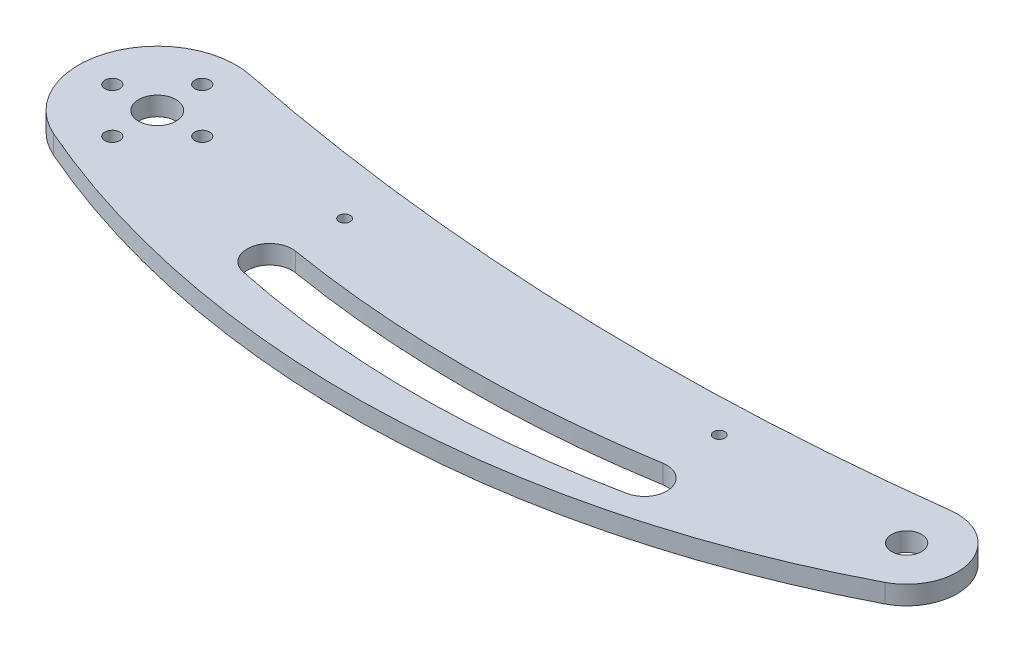
ISO-10303-21;
HEADER;
FILE_DESCRIPTION(('STEP AP214'),'2;1');
FILE_NAME('part.step','',(''),(''),'','','');
FILE_SCHEMA(('AUTOMOTIVE_DESIGN { 1 0 10303 214 1 1 1 1 }'));
ENDSEC;
DATA;
#1=APPLICATION_CONTEXT('core data for automotive mechanical design processes');
#2=APPLICATION_PROTOCOL_DEFINITION('international standard','automotive_design',2000,#1);
#3=PRODUCT_CONTEXT('',#1,'mechanical');
#4=PRODUCT('Part','Part','',(#3));
#5=PRODUCT_RELATED_PRODUCT_CATEGORY('part','',(#4));
#6=PRODUCT_DEFINITION_FORMATION('','',#4);
#7=PRODUCT_DEFINITION_CONTEXT('part definition',#1,'design');
#8=PRODUCT_DEFINITION('design','',#6,#7);
#9=PRODUCT_DEFINITION_SHAPE('','',#8);
#10=(LENGTH_UNIT() NAMED_UNIT(*) SI_UNIT(.MILLI.,.METRE.));
#11=(NAMED_UNIT(*) PLANE_ANGLE_UNIT() SI_UNIT($,.RADIAN.));
#12=(NAMED_UNIT(*) SI_UNIT($,.STERADIAN.) SOLID_ANGLE_UNIT());
#13=UNCERTAINTY_MEASURE_WITH_UNIT(LENGTH_MEASURE(1.E-05),#10,'distance_accuracy_value','');
#14=(GEOMETRIC_REPRESENTATION_CONTEXT(3) GLOBAL_UNCERTAINTY_ASSIGNED_CONTEXT((#13)) GLOBAL_UNIT_ASSIGNED_CONTEXT((#10,
#11,#12)) REPRESENTATION_CONTEXT('',''));
#15=CARTESIAN_POINT('',(0.,0.,0.));
#16=DIRECTION('',(0.,0.,1.));
#17=DIRECTION('',(1.,0.,0.));
#18=AXIS2_PLACEMENT_3D('',#15,#16,#17);
#19=CARTESIAN_POINT('',(161.5734375,5.,-304.333635660657));
#20=DIRECTION('',(0.,1.,0.));
#21=DIRECTION('',(0.,0.,1.));
#22=AXIS2_PLACEMENT_3D('',#19,#20,#21);
#23=PLANE('',#22);
#24=CARTESIAN_POINT('',(50.,5.,0.));
#25=DIRECTION('',(0.,1.,0.));
#26=DIRECTION('',(0.,0.,1.));
#27=AXIS2_PLACEMENT_3D('',#24,#25,#26);
#28=CIRCLE('',#27,1.5);
#29=CARTESIAN_POINT('',(50.,5.,1.5));
#30=VERTEX_POINT('',#29);
#31=EDGE_CURVE('E144',#30,#30,#28,.T.);
#32=ORIENTED_EDGE('',*,*,#31,.F.);
#33=EDGE_LOOP('',(#32));
#34=FACE_BOUND('',#33,.T.);
#35=CARTESIAN_POINT('',(-2.73805120588741E-12,5.,12.));
#36=DIRECTION('',(0.,1.,0.));
#37=DIRECTION('',(0.,0.,1.));
#38=AXIS2_PLACEMENT_3D('',#35,#36,#37);
#39=CIRCLE('',#38,1.99999999999742);
#40=CARTESIAN_POINT('',(-2.73805120588741E-12,5.,13.9999999999974));
#41=VERTEX_POINT('',#40);
#42=EDGE_CURVE('E168',#41,#41,#39,.T.);
#43=ORIENTED_EDGE('',*,*,#42,.F.);
#44=EDGE_LOOP('',(#43));
#45=FACE_BOUND('',#44,.T.);
#46=CARTESIAN_POINT('',(200.,5.,0.));
#47=DIRECTION('',(0.,1.,0.));
#48=DIRECTION('',(0.,0.,1.));
#49=AXIS2_PLACEMENT_3D('',#46,#47,#48);
#50=CIRCLE('',#49,3.99999999999999);
#51=CARTESIAN_POINT('',(200.,5.,3.99999999999999));
#52=VERTEX_POINT('',#51);
#53=EDGE_CURVE('E184',#52,#52,#50,.T.);
#54=ORIENTED_EDGE('',*,*,#53,.F.);
#55=EDGE_LOOP('',(#54));
#56=FACE_BOUND('',#55,.T.);
#57=CARTESIAN_POINT('',(0.,5.,0.));
#58=DIRECTION('',(0.,1.,0.));
#59=DIRECTION('',(0.,0.,1.));
#60=AXIS2_PLACEMENT_3D('',#57,#58,#59);
#61=CIRCLE('',#60,5.);
#62=CARTESIAN_POINT('',(0.,5.,5.));
#63=VERTEX_POINT('',#62);
#64=EDGE_CURVE('E200',#63,#63,#61,.T.);
#65=ORIENTED_EDGE('',*,*,#64,.F.);
#66=EDGE_LOOP('',(#65));
#67=FACE_BOUND('',#66,.T.);
#68=CARTESIAN_POINT('',(123.146875,5.,-608.667271321314));
#69=DIRECTION('',(0.,-1.,0.));
#70=DIRECTION('',(0.,0.,1.));
#71=AXIS2_PLACEMENT_3D('',#68,#69,#70);
#72=CIRCLE('',#71,600.);
#73=CARTESIAN_POINT('',(198.308855440098,5.,-13.3936563371438));
#74=VERTEX_POINT('',#73);
#75=CARTESIAN_POINT('',(4.16438707729469,5.,-20.5829512041024));
#76=VERTEX_POINT('',#75);
#77=EDGE_CURVE('E208',#74,#76,#72,.T.);
#78=ORIENTED_EDGE('',*,*,#77,.T.);
#79=CARTESIAN_POINT('',(0.,5.,0.));
#80=DIRECTION('',(0.,1.,0.));
#81=DIRECTION('',(0.,0.,1.));
#82=AXIS2_PLACEMENT_3D('',#79,#80,#81);
#83=CIRCLE('',#82,21.);
#84=CARTESIAN_POINT('',(-8.36990993449789,5.,19.2599223178182));
#85=VERTEX_POINT('',#84);
#86=EDGE_CURVE('E212',#76,#85,#83,.T.);
#87=ORIENTED_EDGE('',*,*,#86,.T.);
#88=CARTESIAN_POINT('',(91.271875,5.,-210.024867180018));
#89=DIRECTION('',(0.,1.,0.));
#90=DIRECTION('',(0.,0.,1.));
#91=AXIS2_PLACEMENT_3D('',#88,#89,#90);
#92=CIRCLE('',#91,250.);
#93=CARTESIAN_POINT('',(206.206468023256,5.,11.9887344901913));
#94=VERTEX_POINT('',#93);
#95=EDGE_CURVE('E216',#85,#94,#92,.T.);
#96=ORIENTED_EDGE('',*,*,#95,.T.);
#97=CARTESIAN_POINT('',(200.,5.,0.));
#98=DIRECTION('',(0.,1.,0.));
#99=DIRECTION('',(0.,0.,1.));
#100=AXIS2_PLACEMENT_3D('',#97,#98,#99);
#101=CIRCLE('',#100,13.5);
#102=EDGE_CURVE('E219',#94,#74,#101,.T.);
#103=ORIENTED_EDGE('',*,*,#102,.T.);
#104=EDGE_LOOP('',(#78,#87,#96,#103));
#105=FACE_BOUND('',#104,.T.);
#106=CARTESIAN_POINT('',(0.,5.,-12.));
#107=DIRECTION('',(0.,1.,0.));
#108=DIRECTION('',(0.,0.,1.));
#109=AXIS2_PLACEMENT_3D('',#106,#107,#108);
#110=CIRCLE('',#109,2.);
#111=CARTESIAN_POINT('',(0.,5.,-10.));
#112=VERTEX_POINT('',#111);
#113=EDGE_CURVE('E192',#112,#112,#110,.T.);
#114=ORIENTED_EDGE('',*,*,#113,.F.);
#115=EDGE_LOOP('',(#114));
#116=FACE_BOUND('',#115,.T.);
#117=CARTESIAN_POINT('',(12.,5.,0.));
#118=DIRECTION('',(0.,1.,0.));
#119=DIRECTION('',(0.,0.,1.));
#120=AXIS2_PLACEMENT_3D('',#117,#118,#119);
#121=CIRCLE('',#120,2.00000000000004);
#122=CARTESIAN_POINT('',(12.,5.,1.99999999999999));
#123=VERTEX_POINT('',#122);
#124=EDGE_CURVE('E176',#123,#123,#121,.T.);
#125=ORIENTED_EDGE('',*,*,#124,.F.);
#126=EDGE_LOOP('',(#125));
#127=FACE_BOUND('',#126,.T.);
#128=CARTESIAN_POINT('',(-12.,5.,0.));
#129=DIRECTION('',(0.,1.,0.));
#130=DIRECTION('',(0.,0.,1.));
#131=AXIS2_PLACEMENT_3D('',#128,#129,#130);
#132=CIRCLE('',#131,1.99999999999999);
#133=CARTESIAN_POINT('',(-12.,5.,1.9999999999999));
#134=VERTEX_POINT('',#133);
#135=EDGE_CURVE('E160',#134,#134,#132,.T.);
#136=ORIENTED_EDGE('',*,*,#135,.F.);
#137=EDGE_LOOP('',(#136));
#138=FACE_BOUND('',#137,.T.);
#139=CARTESIAN_POINT('',(150.,5.,20.));
#140=DIRECTION('',(0.,1.,0.));
#141=DIRECTION('',(0.,0.,1.));
#142=AXIS2_PLACEMENT_3D('',#139,#140,#141);
#143=CIRCLE('',#142,6.00000000000001);
#144=CARTESIAN_POINT('',(151.229508397051,5.,25.8726747825485));
#145=VERTEX_POINT('',#144);
#146=CARTESIAN_POINT('',(149.019607843137,5.,14.08063928969));
#147=VERTEX_POINT('',#146);
#148=EDGE_CURVE('E118',#145,#147,#143,.T.);
#149=ORIENTED_EDGE('',*,*,#148,.F.);
#150=CARTESIAN_POINT('',(100.,5.,-218.822109529248));
#151=DIRECTION('',(0.,1.,0.));
#152=DIRECTION('',(0.,0.,1.));
#153=AXIS2_PLACEMENT_3D('',#150,#151,#152);
#154=CIRCLE('',#153,250.);
#155=CARTESIAN_POINT('',(48.7704916029489,5.,25.8726747825485));
#156=VERTEX_POINT('',#155);
#157=EDGE_CURVE('E109',#156,#145,#154,.T.);
#158=ORIENTED_EDGE('',*,*,#157,.F.);
#159=CARTESIAN_POINT('',(50.,5.,20.));
#160=DIRECTION('',(0.,1.,0.));
#161=DIRECTION('',(0.,0.,1.));
#162=AXIS2_PLACEMENT_3D('',#159,#160,#161);
#163=CIRCLE('',#162,6.);
#164=CARTESIAN_POINT('',(50.9803921568628,5.,14.08063928969));
#165=VERTEX_POINT('',#164);
#166=EDGE_CURVE('E136',#165,#156,#163,.T.);
#167=ORIENTED_EDGE('',*,*,#166,.F.);
#168=CARTESIAN_POINT('',(100.,5.,-281.887396225811));
#169=DIRECTION('',(0.,-1.,0.));
#170=DIRECTION('',(0.,0.,1.));
#171=AXIS2_PLACEMENT_3D('',#168,#169,#170);
#172=CIRCLE('',#171,300.);
#173=EDGE_CURVE('E132',#147,#165,#172,.T.);
#174=ORIENTED_EDGE('',*,*,#173,.F.);
#175=EDGE_LOOP('',(#149,#158,#167,#174));
#176=FACE_BOUND('',#175,.T.);
#177=CARTESIAN_POINT('',(150.,5.,0.));
#178=DIRECTION('',(0.,1.,0.));
#179=DIRECTION('',(0.,0.,1.));
#180=AXIS2_PLACEMENT_3D('',#177,#178,#179);
#181=CIRCLE('',#180,1.5);
#182=CARTESIAN_POINT('',(150.,5.,1.5));
#183=VERTEX_POINT('',#182);
#184=EDGE_CURVE('E342',#183,#183,#181,.T.);
#185=ORIENTED_EDGE('',*,*,#184,.F.);
#186=EDGE_LOOP('',(#185));
#187=FACE_BOUND('',#186,.T.);
#188=ADVANCED_FACE('F43',(#34,#45,#56,#67,#105,#116,#127,#138,#176,#187),#23,.T.);
#189=CARTESIAN_POINT('',(161.5734375,0.,-304.333635660657));
#190=DIRECTION('',(0.,1.,0.));
#191=DIRECTION('',(0.,0.,1.));
#192=AXIS2_PLACEMENT_3D('',#189,#190,#191);
#193=PLANE('',#192);
#194=CARTESIAN_POINT('',(-12.,0.,0.));
#195=DIRECTION('',(0.,1.,0.));
#196=DIRECTION('',(0.,0.,1.));
#197=AXIS2_PLACEMENT_3D('',#194,#195,#196);
#198=CIRCLE('',#197,1.99999999999999);
#199=CARTESIAN_POINT('',(-12.,0.,1.9999999999999));
#200=VERTEX_POINT('',#199);
#201=EDGE_CURVE('E127',#200,#200,#198,.T.);
#202=ORIENTED_EDGE('',*,*,#201,.T.);
#203=EDGE_LOOP('',(#202));
#204=FACE_BOUND('',#203,.T.);
#205=CARTESIAN_POINT('',(-2.73805120588741E-12,0.,12.));
#206=DIRECTION('',(0.,1.,0.));
#207=DIRECTION('',(0.,0.,1.));
#208=AXIS2_PLACEMENT_3D('',#205,#206,#207);
#209=CIRCLE('',#208,1.99999999999742);
#210=CARTESIAN_POINT('',(-2.73805120588741E-12,0.,13.9999999999974));
#211=VERTEX_POINT('',#210);
#212=EDGE_CURVE('E164',#211,#211,#209,.T.);
#213=ORIENTED_EDGE('',*,*,#212,.T.);
#214=EDGE_LOOP('',(#213));
#215=FACE_BOUND('',#214,.T.);
#216=CARTESIAN_POINT('',(12.,0.,0.));
#217=DIRECTION('',(0.,1.,0.));
#218=DIRECTION('',(0.,0.,1.));
#219=AXIS2_PLACEMENT_3D('',#216,#217,#218);
#220=CIRCLE('',#219,2.00000000000004);
#221=CARTESIAN_POINT('',(12.,0.,1.99999999999999));
#222=VERTEX_POINT('',#221);
#223=EDGE_CURVE('E172',#222,#222,#220,.T.);
#224=ORIENTED_EDGE('',*,*,#223,.T.);
#225=EDGE_LOOP('',(#224));
#226=FACE_BOUND('',#225,.T.);
#227=CARTESIAN_POINT('',(200.,0.,0.));
#228=DIRECTION('',(0.,1.,0.));
#229=DIRECTION('',(0.,0.,1.));
#230=AXIS2_PLACEMENT_3D('',#227,#228,#229);
#231=CIRCLE('',#230,3.99999999999999);
#232=CARTESIAN_POINT('',(200.,0.,3.99999999999999));
#233=VERTEX_POINT('',#232);
#234=EDGE_CURVE('E180',#233,#233,#231,.T.);
#235=ORIENTED_EDGE('',*,*,#234,.T.);
#236=EDGE_LOOP('',(#235));
#237=FACE_BOUND('',#236,.T.);
#238=CARTESIAN_POINT('',(0.,0.,-12.));
#239=DIRECTION('',(0.,1.,0.));
#240=DIRECTION('',(0.,0.,1.));
#241=AXIS2_PLACEMENT_3D('',#238,#239,#240);
#242=CIRCLE('',#241,2.);
#243=CARTESIAN_POINT('',(0.,0.,-10.));
#244=VERTEX_POINT('',#243);
#245=EDGE_CURVE('E188',#244,#244,#242,.T.);
#246=ORIENTED_EDGE('',*,*,#245,.T.);
#247=EDGE_LOOP('',(#246));
#248=FACE_BOUND('',#247,.T.);
#249=CARTESIAN_POINT('',(0.,0.,0.));
#250=DIRECTION('',(0.,1.,0.));
#251=DIRECTION('',(0.,0.,1.));
#252=AXIS2_PLACEMENT_3D('',#249,#250,#251);
#253=CIRCLE('',#252,5.);
#254=CARTESIAN_POINT('',(0.,0.,5.));
#255=VERTEX_POINT('',#254);
#256=EDGE_CURVE('E196',#255,#255,#253,.T.);
#257=ORIENTED_EDGE('',*,*,#256,.T.);
#258=EDGE_LOOP('',(#257));
#259=FACE_BOUND('',#258,.T.);
#260=CARTESIAN_POINT('',(123.146875,0.,-608.667271321314));
#261=DIRECTION('',(0.,-1.,0.));
#262=DIRECTION('',(0.,0.,1.));
#263=AXIS2_PLACEMENT_3D('',#260,#261,#262);
#264=CIRCLE('',#263,600.);
#265=CARTESIAN_POINT('',(198.308855440098,0.,-13.3936563371438));
#266=VERTEX_POINT('',#265);
#267=CARTESIAN_POINT('',(4.16438707729469,0.,-20.5829512041024));
#268=VERTEX_POINT('',#267);
#269=EDGE_CURVE('E204',#266,#268,#264,.T.);
#270=ORIENTED_EDGE('',*,*,#269,.F.);
#271=CARTESIAN_POINT('',(200.,0.,0.));
#272=DIRECTION('',(0.,1.,0.));
#273=DIRECTION('',(0.,0.,1.));
#274=AXIS2_PLACEMENT_3D('',#271,#272,#273);
#275=CIRCLE('',#274,13.5);
#276=CARTESIAN_POINT('',(206.206468023256,0.,11.9887344901913));
#277=VERTEX_POINT('',#276);
#278=EDGE_CURVE('E213',#277,#266,#275,.T.);
#279=ORIENTED_EDGE('',*,*,#278,.F.);
#280=CARTESIAN_POINT('',(91.271875,0.,-210.024867180018));
#281=DIRECTION('',(0.,1.,0.));
#282=DIRECTION('',(0.,0.,1.));
#283=AXIS2_PLACEMENT_3D('',#280,#281,#282);
#284=CIRCLE('',#283,250.);
#285=CARTESIAN_POINT('',(-8.36990993449789,0.,19.2599223178182));
#286=VERTEX_POINT('',#285);
#287=EDGE_CURVE('E229',#286,#277,#284,.T.);
#288=ORIENTED_EDGE('',*,*,#287,.F.);
#289=CARTESIAN_POINT('',(0.,0.,0.));
#290=DIRECTION('',(0.,1.,0.));
#291=DIRECTION('',(0.,0.,1.));
#292=AXIS2_PLACEMENT_3D('',#289,#290,#291);
#293=CIRCLE('',#292,21.);
#294=EDGE_CURVE('E226',#268,#286,#293,.T.);
#295=ORIENTED_EDGE('',*,*,#294,.F.);
#296=EDGE_LOOP('',(#270,#279,#288,#295));
#297=FACE_BOUND('',#296,.T.);
#298=CARTESIAN_POINT('',(100.,0.,-218.822109529248));
#299=DIRECTION('',(0.,1.,0.));
#300=DIRECTION('',(0.,0.,1.));
#301=AXIS2_PLACEMENT_3D('',#298,#299,#300);
#302=CIRCLE('',#301,250.);
#303=CARTESIAN_POINT('',(48.7704916029489,0.,25.8726747825485));
#304=VERTEX_POINT('',#303);
#305=CARTESIAN_POINT('',(151.229508397051,0.,25.8726747825485));
#306=VERTEX_POINT('',#305);
#307=EDGE_CURVE('E67',#304,#306,#302,.T.);
#308=ORIENTED_EDGE('',*,*,#307,.T.);
#309=CARTESIAN_POINT('',(150.,0.,20.));
#310=DIRECTION('',(0.,1.,0.));
#311=DIRECTION('',(0.,0.,1.));
#312=AXIS2_PLACEMENT_3D('',#309,#310,#311);
#313=CIRCLE('',#312,6.00000000000001);
#314=CARTESIAN_POINT('',(149.019607843137,0.,14.08063928969));
#315=VERTEX_POINT('',#314);
#316=EDGE_CURVE('E125',#306,#315,#313,.T.);
#317=ORIENTED_EDGE('',*,*,#316,.T.);
#318=CARTESIAN_POINT('',(100.,0.,-281.887396225811));
#319=DIRECTION('',(0.,-1.,0.));
#320=DIRECTION('',(0.,0.,1.));
#321=AXIS2_PLACEMENT_3D('',#318,#319,#320);
#322=CIRCLE('',#321,300.);
#323=CARTESIAN_POINT('',(50.9803921568628,0.,14.0806392896899));
#324=VERTEX_POINT('',#323);
#325=EDGE_CURVE('E147',#315,#324,#322,.T.);
#326=ORIENTED_EDGE('',*,*,#325,.T.);
#327=CARTESIAN_POINT('',(50.,0.,20.));
#328=DIRECTION('',(0.,1.,0.));
#329=DIRECTION('',(0.,0.,1.));
#330=AXIS2_PLACEMENT_3D('',#327,#328,#329);
#331=CIRCLE('',#330,6.);
#332=EDGE_CURVE('E119',#324,#304,#331,.T.);
#333=ORIENTED_EDGE('',*,*,#332,.T.);
#334=EDGE_LOOP('',(#308,#317,#326,#333));
#335=FACE_BOUND('',#334,.T.);
#336=CARTESIAN_POINT('',(50.,0.,0.));
#337=DIRECTION('',(0.,1.,0.));
#338=DIRECTION('',(0.,0.,1.));
#339=AXIS2_PLACEMENT_3D('',#336,#337,#338);
#340=CIRCLE('',#339,1.5);
#341=CARTESIAN_POINT('',(50.,0.,1.5));
#342=VERTEX_POINT('',#341);
#343=EDGE_CURVE('E350',#342,#342,#340,.T.);
#344=ORIENTED_EDGE('',*,*,#343,.T.);
#345=EDGE_LOOP('',(#344));
#346=FACE_BOUND('',#345,.T.);
#347=CARTESIAN_POINT('',(150.,0.,0.));
#348=DIRECTION('',(0.,1.,0.));
#349=DIRECTION('',(0.,0.,1.));
#350=AXIS2_PLACEMENT_3D('',#347,#348,#349);
#351=CIRCLE('',#350,1.5);
#352=CARTESIAN_POINT('',(150.,0.,1.5));
#353=VERTEX_POINT('',#352);
#354=EDGE_CURVE('E345',#353,#353,#351,.T.);
#355=ORIENTED_EDGE('',*,*,#354,.T.);
#356=EDGE_LOOP('',(#355));
#357=FACE_BOUND('',#356,.T.);
#358=ADVANCED_FACE('F252',(#204,#215,#226,#237,#248,#259,#297,#335,#346,#357),#193,.F.);
#359=CARTESIAN_POINT('',(123.146875,5.,-608.667271321314));
#360=DIRECTION('',(0.,-1.,0.));
#361=DIRECTION('',(0.,0.,-1.));
#362=AXIS2_PLACEMENT_3D('',#359,#360,#361);
#363=CYLINDRICAL_SURFACE('',#362,600.);
#364=ORIENTED_EDGE('',*,*,#269,.T.);
#365=DIRECTION('',(0.,-1.,0.));
#366=VECTOR('',#365,1.);
#367=CARTESIAN_POINT('',(4.16438707729469,5.,-20.5829512041024));
#368=LINE('',#367,#366);
#369=EDGE_CURVE('E11',#76,#268,#368,.T.);
#370=ORIENTED_EDGE('',*,*,#369,.F.);
#371=ORIENTED_EDGE('',*,*,#77,.F.);
#372=DIRECTION('',(0.,-1.,0.));
#373=VECTOR('',#372,1.);
#374=CARTESIAN_POINT('',(198.308855440098,5.,-13.3936563371438));
#375=LINE('',#374,#373);
#376=EDGE_CURVE('E222',#74,#266,#375,.T.);
#377=ORIENTED_EDGE('',*,*,#376,.T.);
#378=EDGE_LOOP('',(#364,#370,#371,#377));
#379=FACE_BOUND('',#378,.T.);
#380=ADVANCED_FACE('F45',(#379),#363,.F.);
#381=CARTESIAN_POINT('',(0.,5.,0.));
#382=DIRECTION('',(0.,-1.,0.));
#383=DIRECTION('',(0.,0.,-1.));
#384=AXIS2_PLACEMENT_3D('',#381,#382,#383);
#385=CYLINDRICAL_SURFACE('',#384,21.);
#386=ORIENTED_EDGE('',*,*,#294,.T.);
#387=DIRECTION('',(0.,-1.,0.));
#388=VECTOR('',#387,1.);
#389=CARTESIAN_POINT('',(-8.36990993449789,5.,19.2599223178182));
#390=LINE('',#389,#388);
#391=EDGE_CURVE('E52',#85,#286,#390,.T.);
#392=ORIENTED_EDGE('',*,*,#391,.F.);
#393=ORIENTED_EDGE('',*,*,#86,.F.);
#394=ORIENTED_EDGE('',*,*,#369,.T.);
#395=EDGE_LOOP('',(#386,#392,#393,#394));
#396=FACE_BOUND('',#395,.T.);
#397=ADVANCED_FACE('F263',(#396),#385,.T.);
#398=CARTESIAN_POINT('',(91.271875,5.,-210.024867180018));
#399=DIRECTION('',(0.,-1.,0.));
#400=DIRECTION('',(0.,0.,-1.));
#401=AXIS2_PLACEMENT_3D('',#398,#399,#400);
#402=CYLINDRICAL_SURFACE('',#401,250.);
#403=ORIENTED_EDGE('',*,*,#287,.T.);
#404=DIRECTION('',(0.,-1.,0.));
#405=VECTOR('',#404,1.);
#406=CARTESIAN_POINT('',(206.206468023256,5.,11.9887344901913));
#407=LINE('',#406,#405);
#408=EDGE_CURVE('E237',#94,#277,#407,.T.);
#409=ORIENTED_EDGE('',*,*,#408,.F.);
#410=ORIENTED_EDGE('',*,*,#95,.F.);
#411=ORIENTED_EDGE('',*,*,#391,.T.);
#412=EDGE_LOOP('',(#403,#409,#410,#411));
#413=FACE_BOUND('',#412,.T.);
#414=ADVANCED_FACE('F246',(#413),#402,.T.);
#415=CARTESIAN_POINT('',(200.,5.,0.));
#416=DIRECTION('',(0.,-1.,0.));
#417=DIRECTION('',(0.,0.,-1.));
#418=AXIS2_PLACEMENT_3D('',#415,#416,#417);
#419=CYLINDRICAL_SURFACE('',#418,13.5);
#420=ORIENTED_EDGE('',*,*,#278,.T.);
#421=ORIENTED_EDGE('',*,*,#376,.F.);
#422=ORIENTED_EDGE('',*,*,#102,.F.);
#423=ORIENTED_EDGE('',*,*,#408,.T.);
#424=EDGE_LOOP('',(#420,#421,#422,#423));
#425=FACE_BOUND('',#424,.T.);
#426=ADVANCED_FACE('F256',(#425),#419,.T.);
#427=CARTESIAN_POINT('',(0.,5.,0.));
#428=DIRECTION('',(0.,-1.,0.));
#429=DIRECTION('',(0.,0.,-1.));
#430=AXIS2_PLACEMENT_3D('',#427,#428,#429);
#431=CYLINDRICAL_SURFACE('',#430,5.);
#432=ORIENTED_EDGE('',*,*,#64,.T.);
#433=EDGE_LOOP('',(#432));
#434=FACE_BOUND('',#433,.T.);
#435=ORIENTED_EDGE('',*,*,#256,.F.);
#436=EDGE_LOOP('',(#435));
#437=FACE_BOUND('',#436,.T.);
#438=ADVANCED_FACE('F281',(#434,#437),#431,.F.);
#439=CARTESIAN_POINT('',(0.,5.,-12.));
#440=DIRECTION('',(0.,-1.,0.));
#441=DIRECTION('',(0.,0.,-1.));
#442=AXIS2_PLACEMENT_3D('',#439,#440,#441);
#443=CYLINDRICAL_SURFACE('',#442,2.);
#444=ORIENTED_EDGE('',*,*,#113,.T.);
#445=EDGE_LOOP('',(#444));
#446=FACE_BOUND('',#445,.T.);
#447=ORIENTED_EDGE('',*,*,#245,.F.);
#448=EDGE_LOOP('',(#447));
#449=FACE_BOUND('',#448,.T.);
#450=ADVANCED_FACE('F288',(#446,#449),#443,.F.);
#451=CARTESIAN_POINT('',(200.,5.,0.));
#452=DIRECTION('',(0.,-1.,0.));
#453=DIRECTION('',(0.,0.,-1.));
#454=AXIS2_PLACEMENT_3D('',#451,#452,#453);
#455=CYLINDRICAL_SURFACE('',#454,3.99999999999999);
#456=ORIENTED_EDGE('',*,*,#53,.T.);
#457=EDGE_LOOP('',(#456));
#458=FACE_BOUND('',#457,.T.);
#459=ORIENTED_EDGE('',*,*,#234,.F.);
#460=EDGE_LOOP('',(#459));
#461=FACE_BOUND('',#460,.T.);
#462=ADVANCED_FACE('F293',(#458,#461),#455,.F.);
#463=CARTESIAN_POINT('',(12.,5.,0.));
#464=DIRECTION('',(0.,-1.,0.));
#465=DIRECTION('',(0.,0.,-1.));
#466=AXIS2_PLACEMENT_3D('',#463,#464,#465);
#467=CYLINDRICAL_SURFACE('',#466,2.00000000000004);
#468=ORIENTED_EDGE('',*,*,#124,.T.);
#469=EDGE_LOOP('',(#468));
#470=FACE_BOUND('',#469,.T.);
#471=ORIENTED_EDGE('',*,*,#223,.F.);
#472=EDGE_LOOP('',(#471));
#473=FACE_BOUND('',#472,.T.);
#474=ADVANCED_FACE('F303',(#470,#473),#467,.F.);
#475=CARTESIAN_POINT('',(-2.73805120588741E-12,5.,12.));
#476=DIRECTION('',(0.,-1.,0.));
#477=DIRECTION('',(0.,0.,-1.));
#478=AXIS2_PLACEMENT_3D('',#475,#476,#477);
#479=CYLINDRICAL_SURFACE('',#478,1.99999999999742);
#480=ORIENTED_EDGE('',*,*,#42,.T.);
#481=EDGE_LOOP('',(#480));
#482=FACE_BOUND('',#481,.T.);
#483=ORIENTED_EDGE('',*,*,#212,.F.);
#484=EDGE_LOOP('',(#483));
#485=FACE_BOUND('',#484,.T.);
#486=ADVANCED_FACE('F310',(#482,#485),#479,.F.);
#487=CARTESIAN_POINT('',(-12.,5.,0.));
#488=DIRECTION('',(0.,-1.,0.));
#489=DIRECTION('',(0.,0.,-1.));
#490=AXIS2_PLACEMENT_3D('',#487,#488,#489);
#491=CYLINDRICAL_SURFACE('',#490,1.99999999999999);
#492=ORIENTED_EDGE('',*,*,#135,.T.);
#493=EDGE_LOOP('',(#492));
#494=FACE_BOUND('',#493,.T.);
#495=ORIENTED_EDGE('',*,*,#201,.F.);
#496=EDGE_LOOP('',(#495));
#497=FACE_BOUND('',#496,.T.);
#498=ADVANCED_FACE('F314',(#494,#497),#491,.F.);
#499=CARTESIAN_POINT('',(100.,5.,-218.822109529248));
#500=DIRECTION('',(0.,-1.,0.));
#501=DIRECTION('',(0.,0.,-1.));
#502=AXIS2_PLACEMENT_3D('',#499,#500,#501);
#503=CYLINDRICAL_SURFACE('',#502,250.);
#504=ORIENTED_EDGE('',*,*,#307,.F.);
#505=DIRECTION('',(0.,-1.,0.));
#506=VECTOR('',#505,1.);
#507=CARTESIAN_POINT('',(48.7704916029489,5.,25.8726747825485));
#508=LINE('',#507,#506);
#509=EDGE_CURVE('E113',#156,#304,#508,.T.);
#510=ORIENTED_EDGE('',*,*,#509,.F.);
#511=ORIENTED_EDGE('',*,*,#157,.T.);
#512=DIRECTION('',(0.,-1.,0.));
#513=VECTOR('',#512,1.);
#514=CARTESIAN_POINT('',(151.229508397051,5.,25.8726747825485));
#515=LINE('',#514,#513);
#516=EDGE_CURVE('E112',#145,#306,#515,.T.);
#517=ORIENTED_EDGE('',*,*,#516,.T.);
#518=EDGE_LOOP('',(#504,#510,#511,#517));
#519=FACE_BOUND('',#518,.T.);
#520=ADVANCED_FACE('F111',(#519),#503,.F.);
#521=CARTESIAN_POINT('',(150.,5.,20.));
#522=DIRECTION('',(0.,-1.,0.));
#523=DIRECTION('',(0.,0.,-1.));
#524=AXIS2_PLACEMENT_3D('',#521,#522,#523);
#525=CYLINDRICAL_SURFACE('',#524,6.00000000000001);
#526=ORIENTED_EDGE('',*,*,#316,.F.);
#527=ORIENTED_EDGE('',*,*,#516,.F.);
#528=ORIENTED_EDGE('',*,*,#148,.T.);
#529=DIRECTION('',(0.,-1.,0.));
#530=VECTOR('',#529,1.);
#531=CARTESIAN_POINT('',(149.019607843137,5.,14.08063928969));
#532=LINE('',#531,#530);
#533=EDGE_CURVE('E128',#147,#315,#532,.T.);
#534=ORIENTED_EDGE('',*,*,#533,.T.);
#535=EDGE_LOOP('',(#526,#527,#528,#534));
#536=FACE_BOUND('',#535,.T.);
#537=ADVANCED_FACE('F122',(#536),#525,.F.);
#538=CARTESIAN_POINT('',(100.,5.,-281.887396225811));
#539=DIRECTION('',(0.,-1.,0.));
#540=DIRECTION('',(0.,0.,-1.));
#541=AXIS2_PLACEMENT_3D('',#538,#539,#540);
#542=CYLINDRICAL_SURFACE('',#541,300.);
#543=ORIENTED_EDGE('',*,*,#325,.F.);
#544=ORIENTED_EDGE('',*,*,#533,.F.);
#545=ORIENTED_EDGE('',*,*,#173,.T.);
#546=DIRECTION('',(0.,-1.,0.));
#547=VECTOR('',#546,1.);
#548=CARTESIAN_POINT('',(50.9803921568628,5.,14.0806392896899));
#549=LINE('',#548,#547);
#550=EDGE_CURVE('E59',#165,#324,#549,.T.);
#551=ORIENTED_EDGE('',*,*,#550,.T.);
#552=EDGE_LOOP('',(#543,#544,#545,#551));
#553=FACE_BOUND('',#552,.T.);
#554=ADVANCED_FACE('F323',(#553),#542,.T.);
#555=CARTESIAN_POINT('',(50.,5.,20.));
#556=DIRECTION('',(0.,-1.,0.));
#557=DIRECTION('',(0.,0.,-1.));
#558=AXIS2_PLACEMENT_3D('',#555,#556,#557);
#559=CYLINDRICAL_SURFACE('',#558,6.);
#560=ORIENTED_EDGE('',*,*,#332,.F.);
#561=ORIENTED_EDGE('',*,*,#550,.F.);
#562=ORIENTED_EDGE('',*,*,#166,.T.);
#563=ORIENTED_EDGE('',*,*,#509,.T.);
#564=EDGE_LOOP('',(#560,#561,#562,#563));
#565=FACE_BOUND('',#564,.T.);
#566=ADVANCED_FACE('F326',(#565),#559,.F.);
#567=CARTESIAN_POINT('',(50.,5.,0.));
#568=DIRECTION('',(0.,-1.,0.));
#569=DIRECTION('',(0.,0.,-1.));
#570=AXIS2_PLACEMENT_3D('',#567,#568,#569);
#571=CYLINDRICAL_SURFACE('',#570,1.5);
#572=ORIENTED_EDGE('',*,*,#31,.T.);
#573=EDGE_LOOP('',(#572));
#574=FACE_BOUND('',#573,.T.);
#575=ORIENTED_EDGE('',*,*,#343,.F.);
#576=EDGE_LOOP('',(#575));
#577=FACE_BOUND('',#576,.T.);
#578=ADVANCED_FACE('F330',(#574,#577),#571,.F.);
#579=CARTESIAN_POINT('',(150.,5.,0.));
#580=DIRECTION('',(0.,-1.,0.));
#581=DIRECTION('',(0.,0.,-1.));
#582=AXIS2_PLACEMENT_3D('',#579,#580,#581);
#583=CYLINDRICAL_SURFACE('',#582,1.5);
#584=ORIENTED_EDGE('',*,*,#184,.T.);
#585=EDGE_LOOP('',(#584));
#586=FACE_BOUND('',#585,.T.);
#587=ORIENTED_EDGE('',*,*,#354,.F.);
#588=EDGE_LOOP('',(#587));
#589=FACE_BOUND('',#588,.T.);
#590=ADVANCED_FACE('F333',(#586,#589),#583,.F.);
#591=CLOSED_SHELL('',(#188,#358,#380,#397,#414,#426,#438,#450,#462,#474,#486,#498,#520,#537,
#554,#566,#578,#590));
#592=MANIFOLD_SOLID_BREP('B2',#591);
#593=ADVANCED_BREP_SHAPE_REPRESENTATION('',(#18,#592),#14);
#594=SHAPE_DEFINITION_REPRESENTATION(#9,#593);
ENDSEC;
END-ISO-10303-21;
